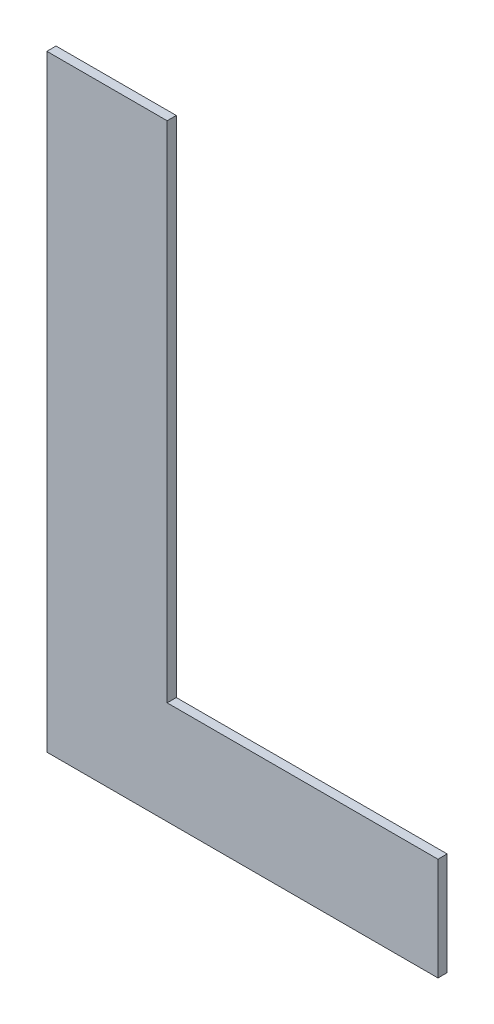
ISO-10303-21;
HEADER;
FILE_DESCRIPTION(('STEP AP214'),'2;1');
FILE_NAME('part.step','',(''),(''),'','','');
FILE_SCHEMA(('AUTOMOTIVE_DESIGN { 1 0 10303 214 1 1 1 1 }'));
ENDSEC;
DATA;
#1=APPLICATION_CONTEXT('core data for automotive mechanical design processes');
#2=APPLICATION_PROTOCOL_DEFINITION('international standard','automotive_design',2000,#1);
#3=PRODUCT_CONTEXT('',#1,'mechanical');
#4=PRODUCT('Part','Part','',(#3));
#5=PRODUCT_RELATED_PRODUCT_CATEGORY('part','',(#4));
#6=PRODUCT_DEFINITION_FORMATION('','',#4);
#7=PRODUCT_DEFINITION_CONTEXT('part definition',#1,'design');
#8=PRODUCT_DEFINITION('design','',#6,#7);
#9=PRODUCT_DEFINITION_SHAPE('','',#8);
#10=(LENGTH_UNIT() NAMED_UNIT(*) SI_UNIT(.MILLI.,.METRE.));
#11=(NAMED_UNIT(*) PLANE_ANGLE_UNIT() SI_UNIT($,.RADIAN.));
#12=(NAMED_UNIT(*) SI_UNIT($,.STERADIAN.) SOLID_ANGLE_UNIT());
#13=UNCERTAINTY_MEASURE_WITH_UNIT(LENGTH_MEASURE(1.E-05),#10,'distance_accuracy_value','');
#14=(GEOMETRIC_REPRESENTATION_CONTEXT(3) GLOBAL_UNCERTAINTY_ASSIGNED_CONTEXT((#13)) GLOBAL_UNIT_ASSIGNED_CONTEXT((#10,
#11,#12)) REPRESENTATION_CONTEXT('',''));
#15=CARTESIAN_POINT('',(0.,0.,0.));
#16=DIRECTION('',(0.,0.,1.));
#17=DIRECTION('',(1.,0.,0.));
#18=AXIS2_PLACEMENT_3D('',#15,#16,#17);
#19=CARTESIAN_POINT('',(3.4201947000674,-0.677335704041417,0.));
#20=DIRECTION('',(0.,-1.,0.));
#21=DIRECTION('',(1.,0.,0.));
#22=AXIS2_PLACEMENT_3D('',#19,#20,#21);
#23=PLANE('',#22);
#24=DIRECTION('',(1.,0.,0.));
#25=VECTOR('',#24,1.);
#26=CARTESIAN_POINT('',(3.4201947000674,-0.677335704041417,0.));
#27=LINE('',#26,#25);
#28=CARTESIAN_POINT('',(3.4201947000674,-0.677335704041417,0.));
#29=VERTEX_POINT('',#28);
#30=CARTESIAN_POINT('',(3.5483134031754,-0.677335704041417,0.));
#31=VERTEX_POINT('',#30);
#32=EDGE_CURVE('E11',#29,#31,#27,.T.);
#33=ORIENTED_EDGE('',*,*,#32,.T.);
#34=DIRECTION('',(0.,0.,1.));
#35=VECTOR('',#34,1.);
#36=CARTESIAN_POINT('',(3.5483134031754,-0.677335704041417,0.));
#37=LINE('',#36,#35);
#38=CARTESIAN_POINT('',(3.5483134031754,-0.677335704041417,0.003));
#39=VERTEX_POINT('',#38);
#40=EDGE_CURVE('E24',#31,#39,#37,.T.);
#41=ORIENTED_EDGE('',*,*,#40,.T.);
#42=DIRECTION('',(1.,0.,0.));
#43=VECTOR('',#42,1.);
#44=CARTESIAN_POINT('',(3.4201947000674,-0.677335704041417,0.003));
#45=LINE('',#44,#43);
#46=CARTESIAN_POINT('',(3.4201947000674,-0.677335704041417,0.003));
#47=VERTEX_POINT('',#46);
#48=EDGE_CURVE('E88',#47,#39,#45,.T.);
#49=ORIENTED_EDGE('',*,*,#48,.F.);
#50=DIRECTION('',(0.,0.,1.));
#51=VECTOR('',#50,1.);
#52=CARTESIAN_POINT('',(3.4201947000674,-0.677335704041417,0.));
#53=LINE('',#52,#51);
#54=EDGE_CURVE('E116',#29,#47,#53,.T.);
#55=ORIENTED_EDGE('',*,*,#54,.F.);
#56=EDGE_LOOP('',(#33,#41,#49,#55));
#57=FACE_BOUND('',#56,.T.);
#58=ADVANCED_FACE('F17',(#57),#23,.T.);
#59=CARTESIAN_POINT('',(3.4201947000674,-0.478504002276747,0.));
#60=DIRECTION('',(-1.,0.,0.));
#61=DIRECTION('',(0.,-1.,0.));
#62=AXIS2_PLACEMENT_3D('',#59,#60,#61);
#63=PLANE('',#62);
#64=DIRECTION('',(0.,-1.,0.));
#65=VECTOR('',#64,1.);
#66=CARTESIAN_POINT('',(3.4201947000674,-0.478504002276747,0.));
#67=LINE('',#66,#65);
#68=CARTESIAN_POINT('',(3.4201947000674,-0.478504002276747,0.));
#69=VERTEX_POINT('',#68);
#70=EDGE_CURVE('E113',#69,#29,#67,.T.);
#71=ORIENTED_EDGE('',*,*,#70,.T.);
#72=ORIENTED_EDGE('',*,*,#54,.T.);
#73=DIRECTION('',(0.,-1.,0.));
#74=VECTOR('',#73,1.);
#75=CARTESIAN_POINT('',(3.4201947000674,-0.478504002276747,0.003));
#76=LINE('',#75,#74);
#77=CARTESIAN_POINT('',(3.4201947000674,-0.478504002276747,0.003));
#78=VERTEX_POINT('',#77);
#79=EDGE_CURVE('E111',#78,#47,#76,.T.);
#80=ORIENTED_EDGE('',*,*,#79,.F.);
#81=DIRECTION('',(0.,0.,1.));
#82=VECTOR('',#81,1.);
#83=CARTESIAN_POINT('',(3.4201947000674,-0.478504002276747,0.));
#84=LINE('',#83,#82);
#85=EDGE_CURVE('E108',#69,#78,#84,.T.);
#86=ORIENTED_EDGE('',*,*,#85,.F.);
#87=EDGE_LOOP('',(#71,#72,#80,#86));
#88=FACE_BOUND('',#87,.T.);
#89=ADVANCED_FACE('F127',(#88),#63,.T.);
#90=CARTESIAN_POINT('',(3.4596012660512,-0.478504002276747,0.));
#91=DIRECTION('',(0.,1.,0.));
#92=DIRECTION('',(-1.,0.,0.));
#93=AXIS2_PLACEMENT_3D('',#90,#91,#92);
#94=PLANE('',#93);
#95=DIRECTION('',(-1.,0.,0.));
#96=VECTOR('',#95,1.);
#97=CARTESIAN_POINT('',(3.4596012660512,-0.478504002276747,0.));
#98=LINE('',#97,#96);
#99=CARTESIAN_POINT('',(3.4596012660512,-0.478504002276747,0.));
#100=VERTEX_POINT('',#99);
#101=EDGE_CURVE('E105',#100,#69,#98,.T.);
#102=ORIENTED_EDGE('',*,*,#101,.T.);
#103=ORIENTED_EDGE('',*,*,#85,.T.);
#104=DIRECTION('',(-1.,0.,0.));
#105=VECTOR('',#104,1.);
#106=CARTESIAN_POINT('',(3.4596012660512,-0.478504002276747,0.003));
#107=LINE('',#106,#105);
#108=CARTESIAN_POINT('',(3.4596012660512,-0.478504002276747,0.003));
#109=VERTEX_POINT('',#108);
#110=EDGE_CURVE('E102',#109,#78,#107,.T.);
#111=ORIENTED_EDGE('',*,*,#110,.F.);
#112=DIRECTION('',(0.,0.,1.));
#113=VECTOR('',#112,1.);
#114=CARTESIAN_POINT('',(3.4596012660512,-0.478504002276747,0.));
#115=LINE('',#114,#113);
#116=EDGE_CURVE('E99',#100,#109,#115,.T.);
#117=ORIENTED_EDGE('',*,*,#116,.F.);
#118=EDGE_LOOP('',(#102,#103,#111,#117));
#119=FACE_BOUND('',#118,.T.);
#120=ADVANCED_FACE('F124',(#119),#94,.T.);
#121=CARTESIAN_POINT('',(3.4596012660512,-0.643632670119949,0.));
#122=DIRECTION('',(1.,0.,0.));
#123=DIRECTION('',(0.,1.,0.));
#124=AXIS2_PLACEMENT_3D('',#121,#122,#123);
#125=PLANE('',#124);
#126=DIRECTION('',(0.,1.,0.));
#127=VECTOR('',#126,1.);
#128=CARTESIAN_POINT('',(3.4596012660512,-0.643632670119949,0.));
#129=LINE('',#128,#127);
#130=CARTESIAN_POINT('',(3.4596012660512,-0.643632670119949,0.));
#131=VERTEX_POINT('',#130);
#132=EDGE_CURVE('E96',#131,#100,#129,.T.);
#133=ORIENTED_EDGE('',*,*,#132,.T.);
#134=ORIENTED_EDGE('',*,*,#116,.T.);
#135=DIRECTION('',(0.,1.,0.));
#136=VECTOR('',#135,1.);
#137=CARTESIAN_POINT('',(3.4596012660512,-0.643632670119949,0.003));
#138=LINE('',#137,#136);
#139=CARTESIAN_POINT('',(3.4596012660512,-0.643632670119949,0.003));
#140=VERTEX_POINT('',#139);
#141=EDGE_CURVE('E94',#140,#109,#138,.T.);
#142=ORIENTED_EDGE('',*,*,#141,.F.);
#143=DIRECTION('',(0.,0.,1.));
#144=VECTOR('',#143,1.);
#145=CARTESIAN_POINT('',(3.4596012660512,-0.643632670119949,0.));
#146=LINE('',#145,#144);
#147=EDGE_CURVE('E73',#131,#140,#146,.T.);
#148=ORIENTED_EDGE('',*,*,#147,.F.);
#149=EDGE_LOOP('',(#133,#134,#142,#148));
#150=FACE_BOUND('',#149,.T.);
#151=ADVANCED_FACE('F122',(#150),#125,.T.);
#152=CARTESIAN_POINT('',(3.5483134031754,-0.643632670119949,0.));
#153=DIRECTION('',(0.,1.,0.));
#154=DIRECTION('',(-1.,0.,0.));
#155=AXIS2_PLACEMENT_3D('',#152,#153,#154);
#156=PLANE('',#155);
#157=DIRECTION('',(-1.,0.,0.));
#158=VECTOR('',#157,1.);
#159=CARTESIAN_POINT('',(3.5483134031754,-0.643632670119949,0.));
#160=LINE('',#159,#158);
#161=CARTESIAN_POINT('',(3.5483134031754,-0.643632670119949,0.));
#162=VERTEX_POINT('',#161);
#163=EDGE_CURVE('E77',#162,#131,#160,.T.);
#164=ORIENTED_EDGE('',*,*,#163,.T.);
#165=ORIENTED_EDGE('',*,*,#147,.T.);
#166=DIRECTION('',(-1.,0.,0.));
#167=VECTOR('',#166,1.);
#168=CARTESIAN_POINT('',(3.5483134031754,-0.643632670119949,0.003));
#169=LINE('',#168,#167);
#170=CARTESIAN_POINT('',(3.5483134031754,-0.643632670119949,0.003));
#171=VERTEX_POINT('',#170);
#172=EDGE_CURVE('E66',#171,#140,#169,.T.);
#173=ORIENTED_EDGE('',*,*,#172,.F.);
#174=DIRECTION('',(0.,0.,1.));
#175=VECTOR('',#174,1.);
#176=CARTESIAN_POINT('',(3.5483134031754,-0.643632670119949,0.));
#177=LINE('',#176,#175);
#178=EDGE_CURVE('E70',#162,#171,#177,.T.);
#179=ORIENTED_EDGE('',*,*,#178,.F.);
#180=EDGE_LOOP('',(#164,#165,#173,#179));
#181=FACE_BOUND('',#180,.T.);
#182=ADVANCED_FACE('F69',(#181),#156,.T.);
#183=CARTESIAN_POINT('',(3.5483134031754,-0.677335704041417,0.));
#184=DIRECTION('',(1.,0.,0.));
#185=DIRECTION('',(0.,1.,0.));
#186=AXIS2_PLACEMENT_3D('',#183,#184,#185);
#187=PLANE('',#186);
#188=DIRECTION('',(0.,1.,0.));
#189=VECTOR('',#188,1.);
#190=CARTESIAN_POINT('',(3.5483134031754,-0.677335704041417,0.));
#191=LINE('',#190,#189);
#192=EDGE_CURVE('E83',#31,#162,#191,.T.);
#193=ORIENTED_EDGE('',*,*,#192,.T.);
#194=ORIENTED_EDGE('',*,*,#178,.T.);
#195=DIRECTION('',(0.,1.,0.));
#196=VECTOR('',#195,1.);
#197=CARTESIAN_POINT('',(3.5483134031754,-0.677335704041417,0.003));
#198=LINE('',#197,#196);
#199=EDGE_CURVE('E82',#39,#171,#198,.T.);
#200=ORIENTED_EDGE('',*,*,#199,.F.);
#201=ORIENTED_EDGE('',*,*,#40,.F.);
#202=EDGE_LOOP('',(#193,#194,#200,#201));
#203=FACE_BOUND('',#202,.T.);
#204=ADVANCED_FACE('F81',(#203),#187,.T.);
#205=CARTESIAN_POINT('',(3.4842540516214,-0.577919853159082,0.003));
#206=DIRECTION('',(0.,0.,1.));
#207=DIRECTION('',(1.,0.,0.));
#208=AXIS2_PLACEMENT_3D('',#205,#206,#207);
#209=PLANE('',#208);
#210=ORIENTED_EDGE('',*,*,#199,.T.);
#211=ORIENTED_EDGE('',*,*,#172,.T.);
#212=ORIENTED_EDGE('',*,*,#141,.T.);
#213=ORIENTED_EDGE('',*,*,#110,.T.);
#214=ORIENTED_EDGE('',*,*,#79,.T.);
#215=ORIENTED_EDGE('',*,*,#48,.T.);
#216=EDGE_LOOP('',(#210,#211,#212,#213,#214,#215));
#217=FACE_BOUND('',#216,.T.);
#218=ADVANCED_FACE('F86',(#217),#209,.T.);
#219=CARTESIAN_POINT('',(3.4842540516214,-0.577919853159082,0.));
#220=DIRECTION('',(0.,0.,1.));
#221=DIRECTION('',(1.,0.,0.));
#222=AXIS2_PLACEMENT_3D('',#219,#220,#221);
#223=PLANE('',#222);
#224=ORIENTED_EDGE('',*,*,#192,.F.);
#225=ORIENTED_EDGE('',*,*,#32,.F.);
#226=ORIENTED_EDGE('',*,*,#70,.F.);
#227=ORIENTED_EDGE('',*,*,#101,.F.);
#228=ORIENTED_EDGE('',*,*,#132,.F.);
#229=ORIENTED_EDGE('',*,*,#163,.F.);
#230=EDGE_LOOP('',(#224,#225,#226,#227,#228,#229));
#231=FACE_BOUND('',#230,.T.);
#232=ADVANCED_FACE('F119',(#231),#223,.F.);
#233=CLOSED_SHELL('',(#58,#89,#120,#151,#182,#204,#218,#232));
#234=MANIFOLD_SOLID_BREP('B1',#233);
#235=ADVANCED_BREP_SHAPE_REPRESENTATION('',(#18,#234),#14);
#236=SHAPE_DEFINITION_REPRESENTATION(#9,#235);
ENDSEC;
END-ISO-10303-21;
